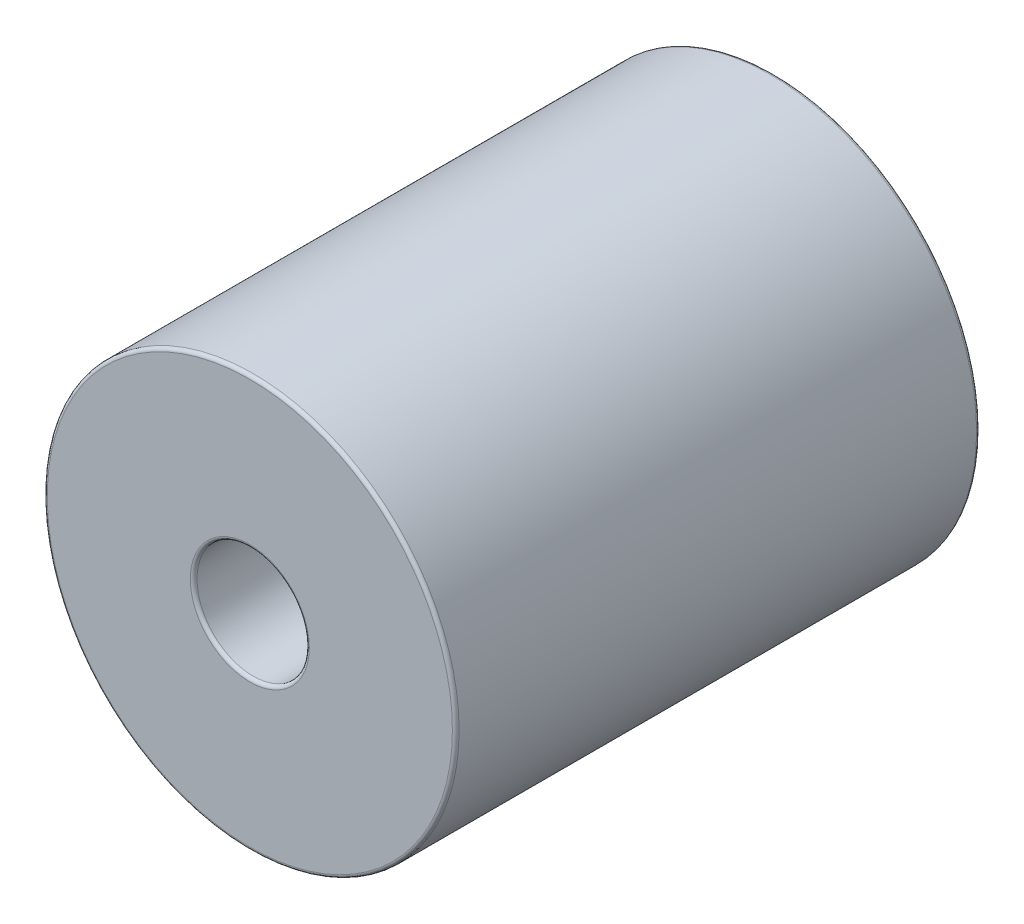
ISO-10303-21;
HEADER;
FILE_DESCRIPTION(('STEP AP214'),'2;1');
FILE_NAME('part.step','',(''),(''),'','','');
FILE_SCHEMA(('AUTOMOTIVE_DESIGN { 1 0 10303 214 1 1 1 1 }'));
ENDSEC;
DATA;
#1=APPLICATION_CONTEXT('core data for automotive mechanical design processes');
#2=APPLICATION_PROTOCOL_DEFINITION('international standard','automotive_design',2000,#1);
#3=PRODUCT_CONTEXT('',#1,'mechanical');
#4=PRODUCT('Part','Part','',(#3));
#5=PRODUCT_RELATED_PRODUCT_CATEGORY('part','',(#4));
#6=PRODUCT_DEFINITION_FORMATION('','',#4);
#7=PRODUCT_DEFINITION_CONTEXT('part definition',#1,'design');
#8=PRODUCT_DEFINITION('design','',#6,#7);
#9=PRODUCT_DEFINITION_SHAPE('','',#8);
#10=(LENGTH_UNIT() NAMED_UNIT(*) SI_UNIT(.MILLI.,.METRE.));
#11=(NAMED_UNIT(*) PLANE_ANGLE_UNIT() SI_UNIT($,.RADIAN.));
#12=(NAMED_UNIT(*) SI_UNIT($,.STERADIAN.) SOLID_ANGLE_UNIT());
#13=UNCERTAINTY_MEASURE_WITH_UNIT(LENGTH_MEASURE(1.E-05),#10,'distance_accuracy_value','');
#14=(GEOMETRIC_REPRESENTATION_CONTEXT(3) GLOBAL_UNCERTAINTY_ASSIGNED_CONTEXT((#13)) GLOBAL_UNIT_ASSIGNED_CONTEXT((#10,
#11,#12)) REPRESENTATION_CONTEXT('',''));
#15=CARTESIAN_POINT('',(0.,0.,0.));
#16=DIRECTION('',(0.,0.,1.));
#17=DIRECTION('',(1.,0.,0.));
#18=AXIS2_PLACEMENT_3D('',#15,#16,#17);
#19=CARTESIAN_POINT('',(0.,0.,2.778125));
#20=DIRECTION('',(0.,0.,1.));
#21=DIRECTION('',(1.,0.,0.));
#22=AXIS2_PLACEMENT_3D('',#19,#20,#21);
#23=PLANE('',#22);
#24=CARTESIAN_POINT('',(0.,0.,2.778125));
#25=DIRECTION('',(0.,0.,1.));
#26=DIRECTION('',(1.,0.,0.));
#27=AXIS2_PLACEMENT_3D('',#24,#25,#26);
#28=CIRCLE('',#27,0.63103125);
#29=CARTESIAN_POINT('',(0.63103125,0.,2.778125));
#30=VERTEX_POINT('',#29);
#31=EDGE_CURVE('E46',#30,#30,#28,.F.);
#32=ORIENTED_EDGE('',*,*,#31,.T.);
#33=EDGE_LOOP('',(#32));
#34=FACE_BOUND('',#33,.T.);
#35=CARTESIAN_POINT('',(0.,0.,2.778125));
#36=DIRECTION('',(0.,0.,1.));
#37=DIRECTION('',(1.,0.,0.));
#38=AXIS2_PLACEMENT_3D('',#35,#36,#37);
#39=CIRCLE('',#38,2.14709375);
#40=CARTESIAN_POINT('',(2.14709375,0.,2.778125));
#41=VERTEX_POINT('',#40);
#42=EDGE_CURVE('E50',#41,#41,#39,.T.);
#43=ORIENTED_EDGE('',*,*,#42,.T.);
#44=EDGE_LOOP('',(#43));
#45=FACE_BOUND('',#44,.T.);
#46=ADVANCED_FACE('F35',(#34,#45),#23,.T.);
#47=CARTESIAN_POINT('',(0.,0.,2.778125));
#48=DIRECTION('',(0.,0.,-1.));
#49=DIRECTION('',(-1.,0.,0.));
#50=AXIS2_PLACEMENT_3D('',#47,#48,#49);
#51=CYLINDRICAL_SURFACE('',#50,2.1828125);
#52=CARTESIAN_POINT('',(0.,0.,-2.74240625));
#53=DIRECTION('',(0.,0.,1.));
#54=DIRECTION('',(1.,0.,0.));
#55=AXIS2_PLACEMENT_3D('',#52,#53,#54);
#56=CIRCLE('',#55,2.1828125);
#57=CARTESIAN_POINT('',(2.1828125,0.,-2.74240625));
#58=VERTEX_POINT('',#57);
#59=EDGE_CURVE('E10',#58,#58,#56,.T.);
#60=ORIENTED_EDGE('',*,*,#59,.T.);
#61=EDGE_LOOP('',(#60));
#62=FACE_BOUND('',#61,.T.);
#63=CARTESIAN_POINT('',(0.,0.,2.74240625));
#64=DIRECTION('',(0.,0.,1.));
#65=DIRECTION('',(1.,0.,0.));
#66=AXIS2_PLACEMENT_3D('',#63,#64,#65);
#67=CIRCLE('',#66,2.1828125);
#68=CARTESIAN_POINT('',(2.1828125,0.,2.74240625));
#69=VERTEX_POINT('',#68);
#70=EDGE_CURVE('E42',#69,#69,#67,.F.);
#71=ORIENTED_EDGE('',*,*,#70,.T.);
#72=EDGE_LOOP('',(#71));
#73=FACE_BOUND('',#72,.T.);
#74=ADVANCED_FACE('F83',(#62,#73),#51,.T.);
#75=CARTESIAN_POINT('',(0.,0.,2.778125));
#76=DIRECTION('',(0.,0.,-1.));
#77=DIRECTION('',(-1.,0.,0.));
#78=AXIS2_PLACEMENT_3D('',#75,#76,#77);
#79=CYLINDRICAL_SURFACE('',#78,0.5953125);
#80=CARTESIAN_POINT('',(0.,0.,-2.74240625));
#81=DIRECTION('',(0.,0.,1.));
#82=DIRECTION('',(1.,0.,0.));
#83=AXIS2_PLACEMENT_3D('',#80,#81,#82);
#84=CIRCLE('',#83,0.5953125);
#85=CARTESIAN_POINT('',(0.5953125,0.,-2.74240625));
#86=VERTEX_POINT('',#85);
#87=EDGE_CURVE('E55',#86,#86,#84,.F.);
#88=ORIENTED_EDGE('',*,*,#87,.T.);
#89=EDGE_LOOP('',(#88));
#90=FACE_BOUND('',#89,.T.);
#91=CARTESIAN_POINT('',(0.,0.,2.74240625));
#92=DIRECTION('',(0.,0.,1.));
#93=DIRECTION('',(1.,0.,0.));
#94=AXIS2_PLACEMENT_3D('',#91,#92,#93);
#95=CIRCLE('',#94,0.5953125);
#96=CARTESIAN_POINT('',(0.5953125,0.,2.74240625));
#97=VERTEX_POINT('',#96);
#98=EDGE_CURVE('E58',#97,#97,#95,.T.);
#99=ORIENTED_EDGE('',*,*,#98,.T.);
#100=EDGE_LOOP('',(#99));
#101=FACE_BOUND('',#100,.T.);
#102=ADVANCED_FACE('F89',(#90,#101),#79,.F.);
#103=CARTESIAN_POINT('',(0.,0.,-2.778125));
#104=DIRECTION('',(0.,0.,1.));
#105=DIRECTION('',(1.,0.,0.));
#106=AXIS2_PLACEMENT_3D('',#103,#104,#105);
#107=PLANE('',#106);
#108=CARTESIAN_POINT('',(0.,0.,-2.778125));
#109=DIRECTION('',(0.,0.,1.));
#110=DIRECTION('',(1.,0.,0.));
#111=AXIS2_PLACEMENT_3D('',#108,#109,#110);
#112=CIRCLE('',#111,0.63103125);
#113=CARTESIAN_POINT('',(0.63103125,0.,-2.778125));
#114=VERTEX_POINT('',#113);
#115=EDGE_CURVE('E61',#114,#114,#112,.T.);
#116=ORIENTED_EDGE('',*,*,#115,.T.);
#117=EDGE_LOOP('',(#116));
#118=FACE_BOUND('',#117,.T.);
#119=CARTESIAN_POINT('',(0.,0.,-2.778125));
#120=DIRECTION('',(0.,0.,1.));
#121=DIRECTION('',(1.,0.,0.));
#122=AXIS2_PLACEMENT_3D('',#119,#120,#121);
#123=CIRCLE('',#122,2.14709375);
#124=CARTESIAN_POINT('',(2.14709375,0.,-2.778125));
#125=VERTEX_POINT('',#124);
#126=EDGE_CURVE('E64',#125,#125,#123,.F.);
#127=ORIENTED_EDGE('',*,*,#126,.T.);
#128=EDGE_LOOP('',(#127));
#129=FACE_BOUND('',#128,.T.);
#130=ADVANCED_FACE('F68',(#118,#129),#107,.F.);
#131=CARTESIAN_POINT('',(0.,0.,-2.74240625));
#132=DIRECTION('',(0.,0.,1.));
#133=DIRECTION('',(1.,0.,0.));
#134=AXIS2_PLACEMENT_3D('',#131,#132,#133);
#135=TOROIDAL_SURFACE('',#134,0.63103125,0.03571875);
#136=ORIENTED_EDGE('',*,*,#87,.F.);
#137=EDGE_LOOP('',(#136));
#138=FACE_BOUND('',#137,.T.);
#139=ORIENTED_EDGE('',*,*,#115,.F.);
#140=EDGE_LOOP('',(#139));
#141=FACE_BOUND('',#140,.T.);
#142=ADVANCED_FACE('F79',(#138,#141),#135,.T.);
#143=CARTESIAN_POINT('',(0.,0.,2.74240625));
#144=DIRECTION('',(0.,0.,1.));
#145=DIRECTION('',(1.,0.,0.));
#146=AXIS2_PLACEMENT_3D('',#143,#144,#145);
#147=TOROIDAL_SURFACE('',#146,0.63103125,0.03571875);
#148=ORIENTED_EDGE('',*,*,#31,.F.);
#149=EDGE_LOOP('',(#148));
#150=FACE_BOUND('',#149,.T.);
#151=ORIENTED_EDGE('',*,*,#98,.F.);
#152=EDGE_LOOP('',(#151));
#153=FACE_BOUND('',#152,.T.);
#154=ADVANCED_FACE('F73',(#150,#153),#147,.T.);
#155=CARTESIAN_POINT('',(0.,0.,-2.74240625));
#156=DIRECTION('',(0.,0.,1.));
#157=DIRECTION('',(1.,0.,0.));
#158=AXIS2_PLACEMENT_3D('',#155,#156,#157);
#159=TOROIDAL_SURFACE('',#158,2.14709375,0.03571875);
#160=ORIENTED_EDGE('',*,*,#126,.F.);
#161=EDGE_LOOP('',(#160));
#162=FACE_BOUND('',#161,.T.);
#163=ORIENTED_EDGE('',*,*,#59,.F.);
#164=EDGE_LOOP('',(#163));
#165=FACE_BOUND('',#164,.T.);
#166=ADVANCED_FACE('F70',(#162,#165),#159,.T.);
#167=CARTESIAN_POINT('',(0.,0.,2.74240625));
#168=DIRECTION('',(0.,0.,1.));
#169=DIRECTION('',(1.,0.,0.));
#170=AXIS2_PLACEMENT_3D('',#167,#168,#169);
#171=TOROIDAL_SURFACE('',#170,2.14709375,0.03571875);
#172=ORIENTED_EDGE('',*,*,#70,.F.);
#173=EDGE_LOOP('',(#172));
#174=FACE_BOUND('',#173,.T.);
#175=ORIENTED_EDGE('',*,*,#42,.F.);
#176=EDGE_LOOP('',(#175));
#177=FACE_BOUND('',#176,.T.);
#178=ADVANCED_FACE('F37',(#174,#177),#171,.T.);
#179=CLOSED_SHELL('',(#46,#74,#102,#130,#142,#154,#166,#178));
#180=MANIFOLD_SOLID_BREP('B2',#179);
#181=ADVANCED_BREP_SHAPE_REPRESENTATION('',(#18,#180),#14);
#182=SHAPE_DEFINITION_REPRESENTATION(#9,#181);
ENDSEC;
END-ISO-10303-21;
